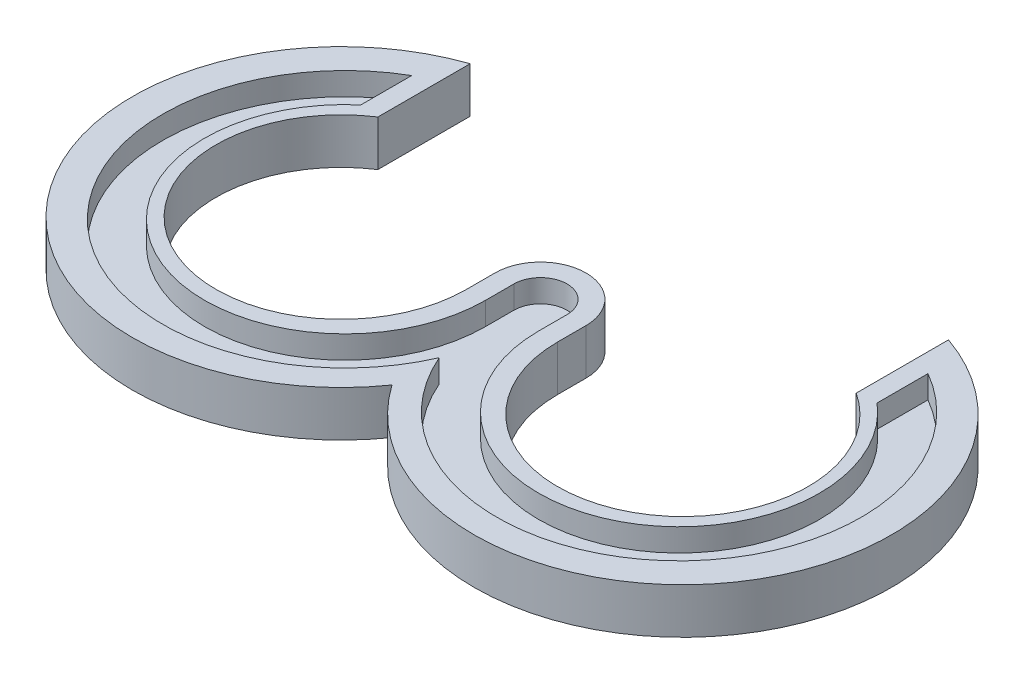
ISO-10303-21;
HEADER;
FILE_DESCRIPTION(('STEP AP214'),'2;1');
FILE_NAME('part.step','',(''),(''),'','','');
FILE_SCHEMA(('AUTOMOTIVE_DESIGN { 1 0 10303 214 1 1 1 1 }'));
ENDSEC;
DATA;
#1=APPLICATION_CONTEXT('core data for automotive mechanical design processes');
#2=APPLICATION_PROTOCOL_DEFINITION('international standard','automotive_design',2000,#1);
#3=PRODUCT_CONTEXT('',#1,'mechanical');
#4=PRODUCT('Part','Part','',(#3));
#5=PRODUCT_RELATED_PRODUCT_CATEGORY('part','',(#4));
#6=PRODUCT_DEFINITION_FORMATION('','',#4);
#7=PRODUCT_DEFINITION_CONTEXT('part definition',#1,'design');
#8=PRODUCT_DEFINITION('design','',#6,#7);
#9=PRODUCT_DEFINITION_SHAPE('','',#8);
#10=(LENGTH_UNIT() NAMED_UNIT(*) SI_UNIT(.MILLI.,.METRE.));
#11=(NAMED_UNIT(*) PLANE_ANGLE_UNIT() SI_UNIT($,.RADIAN.));
#12=(NAMED_UNIT(*) SI_UNIT($,.STERADIAN.) SOLID_ANGLE_UNIT());
#13=UNCERTAINTY_MEASURE_WITH_UNIT(LENGTH_MEASURE(1.E-05),#10,'distance_accuracy_value','');
#14=(GEOMETRIC_REPRESENTATION_CONTEXT(3) GLOBAL_UNCERTAINTY_ASSIGNED_CONTEXT((#13)) GLOBAL_UNIT_ASSIGNED_CONTEXT((#10,
#11,#12)) REPRESENTATION_CONTEXT('',''));
#15=CARTESIAN_POINT('',(0.,0.,0.));
#16=DIRECTION('',(0.,0.,1.));
#17=DIRECTION('',(1.,0.,0.));
#18=AXIS2_PLACEMENT_3D('',#15,#16,#17);
#19=CARTESIAN_POINT('',(-22.5,6.,3.75));
#20=DIRECTION('',(0.,-1.,0.));
#21=DIRECTION('',(0.,0.,-1.));
#22=AXIS2_PLACEMENT_3D('',#19,#20,#21);
#23=CYLINDRICAL_SURFACE('',#22,16.5);
#24=CARTESIAN_POINT('',(-22.5,0.,3.75));
#25=DIRECTION('',(0.,-1.,0.));
#26=DIRECTION('',(0.,0.,1.));
#27=AXIS2_PLACEMENT_3D('',#24,#25,#26);
#28=CIRCLE('',#27,16.5);
#29=CARTESIAN_POINT('',(-5.99999999999999,0.,3.75));
#30=VERTEX_POINT('',#29);
#31=CARTESIAN_POINT('',(-31.5,0.,-10.0793166859393));
#32=VERTEX_POINT('',#31);
#33=EDGE_CURVE('E147',#30,#32,#28,.T.);
#34=ORIENTED_EDGE('',*,*,#33,.T.);
#35=DIRECTION('',(0.,-1.,0.));
#36=VECTOR('',#35,1.);
#37=CARTESIAN_POINT('',(-31.5,6.,-10.0793166859393));
#38=LINE('',#37,#36);
#39=CARTESIAN_POINT('',(-31.5,6.,-10.0793166859393));
#40=VERTEX_POINT('',#39);
#41=EDGE_CURVE('E11',#40,#32,#38,.T.);
#42=ORIENTED_EDGE('',*,*,#41,.F.);
#43=CARTESIAN_POINT('',(-22.5,6.,3.75));
#44=DIRECTION('',(0.,-1.,0.));
#45=DIRECTION('',(0.,0.,1.));
#46=AXIS2_PLACEMENT_3D('',#43,#44,#45);
#47=CIRCLE('',#46,16.5);
#48=CARTESIAN_POINT('',(-5.99999999999999,6.,3.75));
#49=VERTEX_POINT('',#48);
#50=EDGE_CURVE('E165',#49,#40,#47,.T.);
#51=ORIENTED_EDGE('',*,*,#50,.F.);
#52=DIRECTION('',(0.,-1.,0.));
#53=VECTOR('',#52,1.);
#54=CARTESIAN_POINT('',(-5.99999999999999,6.,3.75));
#55=LINE('',#54,#53);
#56=EDGE_CURVE('E143',#49,#30,#55,.T.);
#57=ORIENTED_EDGE('',*,*,#56,.T.);
#58=EDGE_LOOP('',(#34,#42,#51,#57));
#59=FACE_BOUND('',#58,.T.);
#60=ADVANCED_FACE('F33',(#59),#23,.F.);
#61=CARTESIAN_POINT('',(-31.5,6.,-22.2355729203726));
#62=DIRECTION('',(-1.,0.,0.));
#63=DIRECTION('',(0.,0.,1.));
#64=AXIS2_PLACEMENT_3D('',#61,#62,#63);
#65=PLANE('',#64);
#66=DIRECTION('',(0.,0.,-1.));
#67=VECTOR('',#66,1.);
#68=CARTESIAN_POINT('',(-31.5,0.,-22.2355729203726));
#69=LINE('',#68,#67);
#70=CARTESIAN_POINT('',(-31.5,0.,-22.2355729203726));
#71=VERTEX_POINT('',#70);
#72=EDGE_CURVE('E150',#32,#71,#69,.T.);
#73=ORIENTED_EDGE('',*,*,#72,.T.);
#74=DIRECTION('',(0.,-1.,0.));
#75=VECTOR('',#74,1.);
#76=CARTESIAN_POINT('',(-31.5,6.,-22.2355729203726));
#77=LINE('',#76,#75);
#78=CARTESIAN_POINT('',(-31.5,6.,-22.2355729203726));
#79=VERTEX_POINT('',#78);
#80=EDGE_CURVE('E40',#79,#71,#77,.T.);
#81=ORIENTED_EDGE('',*,*,#80,.F.);
#82=DIRECTION('',(0.,0.,-1.));
#83=VECTOR('',#82,1.);
#84=CARTESIAN_POINT('',(-31.5,6.,-22.2355729203726));
#85=LINE('',#84,#83);
#86=EDGE_CURVE('E100',#40,#79,#85,.T.);
#87=ORIENTED_EDGE('',*,*,#86,.F.);
#88=ORIENTED_EDGE('',*,*,#41,.T.);
#89=EDGE_LOOP('',(#73,#81,#87,#88));
#90=FACE_BOUND('',#89,.T.);
#91=ADVANCED_FACE('F365',(#90),#65,.F.);
#92=CARTESIAN_POINT('',(-22.5,6.,3.75));
#93=DIRECTION('',(0.,-1.,0.));
#94=DIRECTION('',(0.,0.,-1.));
#95=AXIS2_PLACEMENT_3D('',#92,#93,#94);
#96=CYLINDRICAL_SURFACE('',#95,27.5);
#97=CARTESIAN_POINT('',(-22.5,0.,3.75));
#98=DIRECTION('',(0.,1.,0.));
#99=DIRECTION('',(0.,0.,1.));
#100=AXIS2_PLACEMENT_3D('',#97,#98,#99);
#101=CIRCLE('',#100,27.5);
#102=CARTESIAN_POINT('',(0.,0.,19.5613883008419));
#103=VERTEX_POINT('',#102);
#104=EDGE_CURVE('E153',#71,#103,#101,.T.);
#105=ORIENTED_EDGE('',*,*,#104,.T.);
#106=DIRECTION('',(0.,-1.,0.));
#107=VECTOR('',#106,1.);
#108=CARTESIAN_POINT('',(0.,6.,19.5613883008419));
#109=LINE('',#108,#107);
#110=CARTESIAN_POINT('',(0.,6.,19.5613883008419));
#111=VERTEX_POINT('',#110);
#112=EDGE_CURVE('E175',#111,#103,#109,.T.);
#113=ORIENTED_EDGE('',*,*,#112,.F.);
#114=CARTESIAN_POINT('',(-22.5,6.,3.75));
#115=DIRECTION('',(0.,1.,0.));
#116=DIRECTION('',(0.,0.,1.));
#117=AXIS2_PLACEMENT_3D('',#114,#115,#116);
#118=CIRCLE('',#117,27.5);
#119=EDGE_CURVE('E183',#79,#111,#118,.T.);
#120=ORIENTED_EDGE('',*,*,#119,.F.);
#121=ORIENTED_EDGE('',*,*,#80,.T.);
#122=EDGE_LOOP('',(#105,#113,#120,#121));
#123=FACE_BOUND('',#122,.T.);
#124=ADVANCED_FACE('F181',(#123),#96,.T.);
#125=CARTESIAN_POINT('',(22.5,6.,3.75));
#126=DIRECTION('',(0.,-1.,0.));
#127=DIRECTION('',(0.,0.,-1.));
#128=AXIS2_PLACEMENT_3D('',#125,#126,#127);
#129=CYLINDRICAL_SURFACE('',#128,27.5);
#130=CARTESIAN_POINT('',(22.5,0.,3.75));
#131=DIRECTION('',(0.,1.,0.));
#132=DIRECTION('',(0.,0.,1.));
#133=AXIS2_PLACEMENT_3D('',#130,#131,#132);
#134=CIRCLE('',#133,27.5);
#135=CARTESIAN_POINT('',(31.5,0.,-22.2355729203726));
#136=VERTEX_POINT('',#135);
#137=EDGE_CURVE('E155',#103,#136,#134,.T.);
#138=ORIENTED_EDGE('',*,*,#137,.T.);
#139=DIRECTION('',(0.,-1.,0.));
#140=VECTOR('',#139,1.);
#141=CARTESIAN_POINT('',(31.5,6.,-22.2355729203726));
#142=LINE('',#141,#140);
#143=CARTESIAN_POINT('',(31.5,6.,-22.2355729203726));
#144=VERTEX_POINT('',#143);
#145=EDGE_CURVE('E172',#144,#136,#142,.T.);
#146=ORIENTED_EDGE('',*,*,#145,.F.);
#147=CARTESIAN_POINT('',(22.5,6.,3.75));
#148=DIRECTION('',(0.,1.,0.));
#149=DIRECTION('',(0.,0.,1.));
#150=AXIS2_PLACEMENT_3D('',#147,#148,#149);
#151=CIRCLE('',#150,27.5);
#152=EDGE_CURVE('E199',#111,#144,#151,.T.);
#153=ORIENTED_EDGE('',*,*,#152,.F.);
#154=ORIENTED_EDGE('',*,*,#112,.T.);
#155=EDGE_LOOP('',(#138,#146,#153,#154));
#156=FACE_BOUND('',#155,.T.);
#157=ADVANCED_FACE('F192',(#156),#129,.T.);
#158=CARTESIAN_POINT('',(31.5,6.,-22.2355729203726));
#159=DIRECTION('',(1.,0.,0.));
#160=DIRECTION('',(0.,0.,-1.));
#161=AXIS2_PLACEMENT_3D('',#158,#159,#160);
#162=PLANE('',#161);
#163=DIRECTION('',(0.,0.,1.));
#164=VECTOR('',#163,1.);
#165=CARTESIAN_POINT('',(31.5,0.,-22.2355729203726));
#166=LINE('',#165,#164);
#167=CARTESIAN_POINT('',(31.5,0.,-10.0793166859393));
#168=VERTEX_POINT('',#167);
#169=EDGE_CURVE('E157',#136,#168,#166,.T.);
#170=ORIENTED_EDGE('',*,*,#169,.T.);
#171=DIRECTION('',(0.,-1.,0.));
#172=VECTOR('',#171,1.);
#173=CARTESIAN_POINT('',(31.5,6.,-10.0793166859393));
#174=LINE('',#173,#172);
#175=CARTESIAN_POINT('',(31.5,6.,-10.0793166859393));
#176=VERTEX_POINT('',#175);
#177=EDGE_CURVE('E169',#176,#168,#174,.T.);
#178=ORIENTED_EDGE('',*,*,#177,.F.);
#179=DIRECTION('',(0.,0.,1.));
#180=VECTOR('',#179,1.);
#181=CARTESIAN_POINT('',(31.5,6.,-22.2355729203726));
#182=LINE('',#181,#180);
#183=EDGE_CURVE('E198',#144,#176,#182,.T.);
#184=ORIENTED_EDGE('',*,*,#183,.F.);
#185=ORIENTED_EDGE('',*,*,#145,.T.);
#186=EDGE_LOOP('',(#170,#178,#184,#185));
#187=FACE_BOUND('',#186,.T.);
#188=ADVANCED_FACE('F196',(#187),#162,.F.);
#189=CARTESIAN_POINT('',(22.5,6.,3.75));
#190=DIRECTION('',(0.,-1.,0.));
#191=DIRECTION('',(0.,0.,-1.));
#192=AXIS2_PLACEMENT_3D('',#189,#190,#191);
#193=CYLINDRICAL_SURFACE('',#192,16.5);
#194=CARTESIAN_POINT('',(22.5,0.,3.75));
#195=DIRECTION('',(0.,-1.,0.));
#196=DIRECTION('',(0.,0.,1.));
#197=AXIS2_PLACEMENT_3D('',#194,#195,#196);
#198=CIRCLE('',#197,16.5);
#199=CARTESIAN_POINT('',(5.99999999999999,0.,3.75));
#200=VERTEX_POINT('',#199);
#201=EDGE_CURVE('E159',#168,#200,#198,.T.);
#202=ORIENTED_EDGE('',*,*,#201,.T.);
#203=DIRECTION('',(0.,-1.,0.));
#204=VECTOR('',#203,1.);
#205=CARTESIAN_POINT('',(5.99999999999999,6.,3.75));
#206=LINE('',#205,#204);
#207=CARTESIAN_POINT('',(5.99999999999999,6.,3.75));
#208=VERTEX_POINT('',#207);
#209=EDGE_CURVE('E138',#208,#200,#206,.T.);
#210=ORIENTED_EDGE('',*,*,#209,.F.);
#211=CARTESIAN_POINT('',(22.5,6.,3.75));
#212=DIRECTION('',(0.,-1.,0.));
#213=DIRECTION('',(0.,0.,1.));
#214=AXIS2_PLACEMENT_3D('',#211,#212,#213);
#215=CIRCLE('',#214,16.5);
#216=EDGE_CURVE('E126',#176,#208,#215,.T.);
#217=ORIENTED_EDGE('',*,*,#216,.F.);
#218=ORIENTED_EDGE('',*,*,#177,.T.);
#219=EDGE_LOOP('',(#202,#210,#217,#218));
#220=FACE_BOUND('',#219,.T.);
#221=ADVANCED_FACE('F385',(#220),#193,.F.);
#222=CARTESIAN_POINT('',(5.99999999999999,6.,3.75));
#223=DIRECTION('',(-1.,0.,0.));
#224=DIRECTION('',(0.,0.,1.));
#225=AXIS2_PLACEMENT_3D('',#222,#223,#224);
#226=PLANE('',#225);
#227=DIRECTION('',(0.,0.,-1.));
#228=VECTOR('',#227,1.);
#229=CARTESIAN_POINT('',(5.99999999999999,0.,3.75));
#230=LINE('',#229,#228);
#231=CARTESIAN_POINT('',(5.99999999999999,0.,0.));
#232=VERTEX_POINT('',#231);
#233=EDGE_CURVE('E135',#200,#232,#230,.T.);
#234=ORIENTED_EDGE('',*,*,#233,.T.);
#235=DIRECTION('',(0.,-1.,0.));
#236=VECTOR('',#235,1.);
#237=CARTESIAN_POINT('',(5.99999999999999,6.,0.));
#238=LINE('',#237,#236);
#239=CARTESIAN_POINT('',(5.99999999999999,6.,0.));
#240=VERTEX_POINT('',#239);
#241=EDGE_CURVE('E132',#240,#232,#238,.T.);
#242=ORIENTED_EDGE('',*,*,#241,.F.);
#243=DIRECTION('',(0.,0.,-1.));
#244=VECTOR('',#243,1.);
#245=CARTESIAN_POINT('',(5.99999999999999,6.,3.75));
#246=LINE('',#245,#244);
#247=EDGE_CURVE('E119',#208,#240,#246,.T.);
#248=ORIENTED_EDGE('',*,*,#247,.F.);
#249=ORIENTED_EDGE('',*,*,#209,.T.);
#250=EDGE_LOOP('',(#234,#242,#248,#249));
#251=FACE_BOUND('',#250,.T.);
#252=ADVANCED_FACE('F133',(#251),#226,.F.);
#253=CARTESIAN_POINT('',(0.,6.,0.));
#254=DIRECTION('',(0.,-1.,0.));
#255=DIRECTION('',(0.,0.,-1.));
#256=AXIS2_PLACEMENT_3D('',#253,#254,#255);
#257=CYLINDRICAL_SURFACE('',#256,5.99999999999999);
#258=CARTESIAN_POINT('',(0.,0.,0.));
#259=DIRECTION('',(0.,1.,0.));
#260=DIRECTION('',(0.,0.,-1.));
#261=AXIS2_PLACEMENT_3D('',#258,#259,#260);
#262=CIRCLE('',#261,5.99999999999999);
#263=CARTESIAN_POINT('',(-5.99999999999999,0.,0.));
#264=VERTEX_POINT('',#263);
#265=EDGE_CURVE('E162',#232,#264,#262,.T.);
#266=ORIENTED_EDGE('',*,*,#265,.T.);
#267=DIRECTION('',(0.,-1.,0.));
#268=VECTOR('',#267,1.);
#269=CARTESIAN_POINT('',(-5.99999999999999,6.,0.));
#270=LINE('',#269,#268);
#271=CARTESIAN_POINT('',(-5.99999999999999,6.,0.));
#272=VERTEX_POINT('',#271);
#273=EDGE_CURVE('E139',#272,#264,#270,.T.);
#274=ORIENTED_EDGE('',*,*,#273,.F.);
#275=CARTESIAN_POINT('',(0.,6.,0.));
#276=DIRECTION('',(0.,1.,0.));
#277=DIRECTION('',(0.,0.,-1.));
#278=AXIS2_PLACEMENT_3D('',#275,#276,#277);
#279=CIRCLE('',#278,5.99999999999999);
#280=EDGE_CURVE('E123',#240,#272,#279,.T.);
#281=ORIENTED_EDGE('',*,*,#280,.F.);
#282=ORIENTED_EDGE('',*,*,#241,.T.);
#283=EDGE_LOOP('',(#266,#274,#281,#282));
#284=FACE_BOUND('',#283,.T.);
#285=ADVANCED_FACE('F141',(#284),#257,.T.);
#286=CARTESIAN_POINT('',(-5.99999999999999,6.,3.75));
#287=DIRECTION('',(1.,0.,0.));
#288=DIRECTION('',(0.,0.,-1.));
#289=AXIS2_PLACEMENT_3D('',#286,#287,#288);
#290=PLANE('',#289);
#291=DIRECTION('',(0.,0.,1.));
#292=VECTOR('',#291,1.);
#293=CARTESIAN_POINT('',(-5.99999999999999,0.,3.75));
#294=LINE('',#293,#292);
#295=EDGE_CURVE('E92',#264,#30,#294,.T.);
#296=ORIENTED_EDGE('',*,*,#295,.T.);
#297=ORIENTED_EDGE('',*,*,#56,.F.);
#298=DIRECTION('',(0.,0.,1.));
#299=VECTOR('',#298,1.);
#300=CARTESIAN_POINT('',(-5.99999999999999,6.,3.75));
#301=LINE('',#300,#299);
#302=EDGE_CURVE('E56',#272,#49,#301,.T.);
#303=ORIENTED_EDGE('',*,*,#302,.F.);
#304=ORIENTED_EDGE('',*,*,#273,.T.);
#305=EDGE_LOOP('',(#296,#297,#303,#304));
#306=FACE_BOUND('',#305,.T.);
#307=ADVANCED_FACE('F372',(#306),#290,.F.);
#308=CARTESIAN_POINT('',(-22.5,6.,3.75));
#309=DIRECTION('',(0.,1.,0.));
#310=DIRECTION('',(0.,0.,1.));
#311=AXIS2_PLACEMENT_3D('',#308,#309,#310);
#312=PLANE('',#311);
#313=CARTESIAN_POINT('',(-22.,6.,3.75));
#314=DIRECTION('',(0.,-1.,0.));
#315=DIRECTION('',(0.,0.,1.));
#316=AXIS2_PLACEMENT_3D('',#313,#314,#315);
#317=CIRCLE('',#316,18.5);
#318=CARTESIAN_POINT('',(-3.5,6.,3.75));
#319=VERTEX_POINT('',#318);
#320=CARTESIAN_POINT('',(-34.,6.,-10.3301278403287));
#321=VERTEX_POINT('',#320);
#322=EDGE_CURVE('E47',#319,#321,#317,.T.);
#323=ORIENTED_EDGE('',*,*,#322,.F.);
#324=DIRECTION('',(0.,0.,1.));
#325=VECTOR('',#324,1.);
#326=CARTESIAN_POINT('',(-3.5,6.,3.75));
#327=LINE('',#326,#325);
#328=CARTESIAN_POINT('',(-3.5,6.,0.));
#329=VERTEX_POINT('',#328);
#330=EDGE_CURVE('E231',#329,#319,#327,.T.);
#331=ORIENTED_EDGE('',*,*,#330,.F.);
#332=CARTESIAN_POINT('',(0.,6.,0.));
#333=DIRECTION('',(0.,1.,0.));
#334=DIRECTION('',(0.,0.,-1.));
#335=AXIS2_PLACEMENT_3D('',#332,#333,#334);
#336=CIRCLE('',#335,3.5);
#337=CARTESIAN_POINT('',(3.5,6.,0.));
#338=VERTEX_POINT('',#337);
#339=EDGE_CURVE('E235',#338,#329,#336,.T.);
#340=ORIENTED_EDGE('',*,*,#339,.F.);
#341=DIRECTION('',(0.,0.,-1.));
#342=VECTOR('',#341,1.);
#343=CARTESIAN_POINT('',(3.5,6.,3.75));
#344=LINE('',#343,#342);
#345=CARTESIAN_POINT('',(3.5,6.,3.75));
#346=VERTEX_POINT('',#345);
#347=EDGE_CURVE('E238',#346,#338,#344,.T.);
#348=ORIENTED_EDGE('',*,*,#347,.F.);
#349=CARTESIAN_POINT('',(22.,6.,3.75));
#350=DIRECTION('',(0.,-1.,0.));
#351=DIRECTION('',(0.,0.,1.));
#352=AXIS2_PLACEMENT_3D('',#349,#350,#351);
#353=CIRCLE('',#352,18.5);
#354=CARTESIAN_POINT('',(34.,6.,-10.3301278403287));
#355=VERTEX_POINT('',#354);
#356=EDGE_CURVE('E241',#355,#346,#353,.T.);
#357=ORIENTED_EDGE('',*,*,#356,.F.);
#358=DIRECTION('',(0.,0.,1.));
#359=VECTOR('',#358,1.);
#360=CARTESIAN_POINT('',(34.,6.,-17.0346096908265));
#361=LINE('',#360,#359);
#362=CARTESIAN_POINT('',(34.,6.,-17.0346096908265));
#363=VERTEX_POINT('',#362);
#364=EDGE_CURVE('E244',#363,#355,#361,.T.);
#365=ORIENTED_EDGE('',*,*,#364,.F.);
#366=CARTESIAN_POINT('',(22.,6.,3.75));
#367=DIRECTION('',(0.,1.,0.));
#368=DIRECTION('',(0.,0.,1.));
#369=AXIS2_PLACEMENT_3D('',#366,#367,#368);
#370=CIRCLE('',#369,24.);
#371=CARTESIAN_POINT('',(0.,6.,13.3416630466254));
#372=VERTEX_POINT('',#371);
#373=EDGE_CURVE('E247',#372,#363,#370,.T.);
#374=ORIENTED_EDGE('',*,*,#373,.F.);
#375=CARTESIAN_POINT('',(-22.,6.,3.75));
#376=DIRECTION('',(0.,1.,0.));
#377=DIRECTION('',(0.,0.,1.));
#378=AXIS2_PLACEMENT_3D('',#375,#376,#377);
#379=CIRCLE('',#378,24.);
#380=CARTESIAN_POINT('',(-34.,6.,-17.0346096908265));
#381=VERTEX_POINT('',#380);
#382=EDGE_CURVE('E250',#381,#372,#379,.T.);
#383=ORIENTED_EDGE('',*,*,#382,.F.);
#384=DIRECTION('',(0.,0.,-1.));
#385=VECTOR('',#384,1.);
#386=CARTESIAN_POINT('',(-34.,6.,-17.0346096908265));
#387=LINE('',#386,#385);
#388=EDGE_CURVE('E253',#321,#381,#387,.T.);
#389=ORIENTED_EDGE('',*,*,#388,.F.);
#390=EDGE_LOOP('',(#323,#331,#340,#348,#357,#365,#374,#383,#389));
#391=FACE_BOUND('',#390,.T.);
#392=ORIENTED_EDGE('',*,*,#50,.T.);
#393=ORIENTED_EDGE('',*,*,#86,.T.);
#394=ORIENTED_EDGE('',*,*,#119,.T.);
#395=ORIENTED_EDGE('',*,*,#152,.T.);
#396=ORIENTED_EDGE('',*,*,#183,.T.);
#397=ORIENTED_EDGE('',*,*,#216,.T.);
#398=ORIENTED_EDGE('',*,*,#247,.T.);
#399=ORIENTED_EDGE('',*,*,#280,.T.);
#400=ORIENTED_EDGE('',*,*,#302,.T.);
#401=EDGE_LOOP('',(#392,#393,#394,#395,#396,#397,#398,#399,#400));
#402=FACE_BOUND('',#401,.T.);
#403=ADVANCED_FACE('F121',(#391,#402),#312,.T.);
#404=CARTESIAN_POINT('',(-22.5,0.,3.75));
#405=DIRECTION('',(0.,1.,0.));
#406=DIRECTION('',(0.,0.,1.));
#407=AXIS2_PLACEMENT_3D('',#404,#405,#406);
#408=PLANE('',#407);
#409=ORIENTED_EDGE('',*,*,#33,.F.);
#410=ORIENTED_EDGE('',*,*,#295,.F.);
#411=ORIENTED_EDGE('',*,*,#265,.F.);
#412=ORIENTED_EDGE('',*,*,#233,.F.);
#413=ORIENTED_EDGE('',*,*,#201,.F.);
#414=ORIENTED_EDGE('',*,*,#169,.F.);
#415=ORIENTED_EDGE('',*,*,#137,.F.);
#416=ORIENTED_EDGE('',*,*,#104,.F.);
#417=ORIENTED_EDGE('',*,*,#72,.F.);
#418=EDGE_LOOP('',(#409,#410,#411,#412,#413,#414,#415,#416,#417));
#419=FACE_BOUND('',#418,.T.);
#420=ADVANCED_FACE('F187',(#419),#408,.F.);
#421=CARTESIAN_POINT('',(-22.,3.,3.75));
#422=DIRECTION('',(0.,1.,0.));
#423=DIRECTION('',(0.,0.,1.));
#424=AXIS2_PLACEMENT_3D('',#421,#422,#423);
#425=CYLINDRICAL_SURFACE('',#424,18.5);
#426=ORIENTED_EDGE('',*,*,#322,.T.);
#427=DIRECTION('',(0.,1.,0.));
#428=VECTOR('',#427,1.);
#429=CARTESIAN_POINT('',(-34.,3.,-10.3301278403287));
#430=LINE('',#429,#428);
#431=CARTESIAN_POINT('',(-34.,3.,-10.3301278403287));
#432=VERTEX_POINT('',#431);
#433=EDGE_CURVE('E206',#432,#321,#430,.T.);
#434=ORIENTED_EDGE('',*,*,#433,.F.);
#435=CARTESIAN_POINT('',(-22.,3.,3.75));
#436=DIRECTION('',(0.,-1.,0.));
#437=DIRECTION('',(0.,0.,1.));
#438=AXIS2_PLACEMENT_3D('',#435,#436,#437);
#439=CIRCLE('',#438,18.5);
#440=CARTESIAN_POINT('',(-3.5,3.,3.75));
#441=VERTEX_POINT('',#440);
#442=EDGE_CURVE('E234',#441,#432,#439,.T.);
#443=ORIENTED_EDGE('',*,*,#442,.F.);
#444=DIRECTION('',(0.,1.,0.));
#445=VECTOR('',#444,1.);
#446=CARTESIAN_POINT('',(-3.5,3.,3.75));
#447=LINE('',#446,#445);
#448=EDGE_CURVE('E151',#441,#319,#447,.T.);
#449=ORIENTED_EDGE('',*,*,#448,.T.);
#450=EDGE_LOOP('',(#426,#434,#443,#449));
#451=FACE_BOUND('',#450,.T.);
#452=ADVANCED_FACE('F289',(#451),#425,.T.);
#453=CARTESIAN_POINT('',(-3.5,3.,3.75));
#454=DIRECTION('',(-1.,0.,0.));
#455=DIRECTION('',(0.,0.,1.));
#456=AXIS2_PLACEMENT_3D('',#453,#454,#455);
#457=PLANE('',#456);
#458=ORIENTED_EDGE('',*,*,#330,.T.);
#459=ORIENTED_EDGE('',*,*,#448,.F.);
#460=DIRECTION('',(0.,0.,1.));
#461=VECTOR('',#460,1.);
#462=CARTESIAN_POINT('',(-3.5,3.,3.75));
#463=LINE('',#462,#461);
#464=CARTESIAN_POINT('',(-3.5,3.,0.));
#465=VERTEX_POINT('',#464);
#466=EDGE_CURVE('E209',#465,#441,#463,.T.);
#467=ORIENTED_EDGE('',*,*,#466,.F.);
#468=DIRECTION('',(0.,1.,0.));
#469=VECTOR('',#468,1.);
#470=CARTESIAN_POINT('',(-3.5,3.,0.));
#471=LINE('',#470,#469);
#472=EDGE_CURVE('E227',#465,#329,#471,.T.);
#473=ORIENTED_EDGE('',*,*,#472,.T.);
#474=EDGE_LOOP('',(#458,#459,#467,#473));
#475=FACE_BOUND('',#474,.T.);
#476=ADVANCED_FACE('F311',(#475),#457,.F.);
#477=CARTESIAN_POINT('',(0.,3.,0.));
#478=DIRECTION('',(0.,1.,0.));
#479=DIRECTION('',(0.,0.,1.));
#480=AXIS2_PLACEMENT_3D('',#477,#478,#479);
#481=CYLINDRICAL_SURFACE('',#480,3.5);
#482=ORIENTED_EDGE('',*,*,#339,.T.);
#483=ORIENTED_EDGE('',*,*,#472,.F.);
#484=CARTESIAN_POINT('',(0.,3.,0.));
#485=DIRECTION('',(0.,1.,0.));
#486=DIRECTION('',(0.,0.,-1.));
#487=AXIS2_PLACEMENT_3D('',#484,#485,#486);
#488=CIRCLE('',#487,3.5);
#489=CARTESIAN_POINT('',(3.5,3.,0.));
#490=VERTEX_POINT('',#489);
#491=EDGE_CURVE('E259',#490,#465,#488,.T.);
#492=ORIENTED_EDGE('',*,*,#491,.F.);
#493=DIRECTION('',(0.,1.,0.));
#494=VECTOR('',#493,1.);
#495=CARTESIAN_POINT('',(3.5,3.,0.));
#496=LINE('',#495,#494);
#497=EDGE_CURVE('E224',#490,#338,#496,.T.);
#498=ORIENTED_EDGE('',*,*,#497,.T.);
#499=EDGE_LOOP('',(#482,#483,#492,#498));
#500=FACE_BOUND('',#499,.T.);
#501=ADVANCED_FACE('F316',(#500),#481,.F.);
#502=CARTESIAN_POINT('',(3.5,3.,3.75));
#503=DIRECTION('',(1.,0.,0.));
#504=DIRECTION('',(0.,0.,-1.));
#505=AXIS2_PLACEMENT_3D('',#502,#503,#504);
#506=PLANE('',#505);
#507=ORIENTED_EDGE('',*,*,#347,.T.);
#508=ORIENTED_EDGE('',*,*,#497,.F.);
#509=DIRECTION('',(0.,0.,-1.));
#510=VECTOR('',#509,1.);
#511=CARTESIAN_POINT('',(3.5,3.,3.75));
#512=LINE('',#511,#510);
#513=CARTESIAN_POINT('',(3.5,3.,3.75));
#514=VERTEX_POINT('',#513);
#515=EDGE_CURVE('E262',#514,#490,#512,.T.);
#516=ORIENTED_EDGE('',*,*,#515,.F.);
#517=DIRECTION('',(0.,1.,0.));
#518=VECTOR('',#517,1.);
#519=CARTESIAN_POINT('',(3.5,3.,3.75));
#520=LINE('',#519,#518);
#521=EDGE_CURVE('E221',#514,#346,#520,.T.);
#522=ORIENTED_EDGE('',*,*,#521,.T.);
#523=EDGE_LOOP('',(#507,#508,#516,#522));
#524=FACE_BOUND('',#523,.T.);
#525=ADVANCED_FACE('F345',(#524),#506,.F.);
#526=CARTESIAN_POINT('',(22.,3.,3.75));
#527=DIRECTION('',(0.,1.,0.));
#528=DIRECTION('',(0.,0.,1.));
#529=AXIS2_PLACEMENT_3D('',#526,#527,#528);
#530=CYLINDRICAL_SURFACE('',#529,18.5);
#531=ORIENTED_EDGE('',*,*,#356,.T.);
#532=ORIENTED_EDGE('',*,*,#521,.F.);
#533=CARTESIAN_POINT('',(22.,3.,3.75));
#534=DIRECTION('',(0.,-1.,0.));
#535=DIRECTION('',(0.,0.,1.));
#536=AXIS2_PLACEMENT_3D('',#533,#534,#535);
#537=CIRCLE('',#536,18.5);
#538=CARTESIAN_POINT('',(34.,3.,-10.3301278403287));
#539=VERTEX_POINT('',#538);
#540=EDGE_CURVE('E265',#539,#514,#537,.T.);
#541=ORIENTED_EDGE('',*,*,#540,.F.);
#542=DIRECTION('',(0.,1.,0.));
#543=VECTOR('',#542,1.);
#544=CARTESIAN_POINT('',(34.,3.,-10.3301278403287));
#545=LINE('',#544,#543);
#546=EDGE_CURVE('E218',#539,#355,#545,.T.);
#547=ORIENTED_EDGE('',*,*,#546,.T.);
#548=EDGE_LOOP('',(#531,#532,#541,#547));
#549=FACE_BOUND('',#548,.T.);
#550=ADVANCED_FACE('F349',(#549),#530,.T.);
#551=CARTESIAN_POINT('',(34.,3.,-17.0346096908265));
#552=DIRECTION('',(-1.,0.,0.));
#553=DIRECTION('',(0.,0.,1.));
#554=AXIS2_PLACEMENT_3D('',#551,#552,#553);
#555=PLANE('',#554);
#556=ORIENTED_EDGE('',*,*,#364,.T.);
#557=ORIENTED_EDGE('',*,*,#546,.F.);
#558=DIRECTION('',(0.,0.,1.));
#559=VECTOR('',#558,1.);
#560=CARTESIAN_POINT('',(34.,3.,-17.0346096908265));
#561=LINE('',#560,#559);
#562=CARTESIAN_POINT('',(34.,3.,-17.0346096908265));
#563=VERTEX_POINT('',#562);
#564=EDGE_CURVE('E268',#563,#539,#561,.T.);
#565=ORIENTED_EDGE('',*,*,#564,.F.);
#566=DIRECTION('',(0.,1.,0.));
#567=VECTOR('',#566,1.);
#568=CARTESIAN_POINT('',(34.,3.,-17.0346096908265));
#569=LINE('',#568,#567);
#570=EDGE_CURVE('E215',#563,#363,#569,.T.);
#571=ORIENTED_EDGE('',*,*,#570,.T.);
#572=EDGE_LOOP('',(#556,#557,#565,#571));
#573=FACE_BOUND('',#572,.T.);
#574=ADVANCED_FACE('F353',(#573),#555,.F.);
#575=CARTESIAN_POINT('',(22.,3.,3.75));
#576=DIRECTION('',(0.,1.,0.));
#577=DIRECTION('',(0.,0.,1.));
#578=AXIS2_PLACEMENT_3D('',#575,#576,#577);
#579=CYLINDRICAL_SURFACE('',#578,24.);
#580=ORIENTED_EDGE('',*,*,#373,.T.);
#581=ORIENTED_EDGE('',*,*,#570,.F.);
#582=CARTESIAN_POINT('',(22.,3.,3.75));
#583=DIRECTION('',(0.,1.,0.));
#584=DIRECTION('',(0.,0.,1.));
#585=AXIS2_PLACEMENT_3D('',#582,#583,#584);
#586=CIRCLE('',#585,24.);
#587=CARTESIAN_POINT('',(0.,3.,13.3416630466254));
#588=VERTEX_POINT('',#587);
#589=EDGE_CURVE('E271',#588,#563,#586,.T.);
#590=ORIENTED_EDGE('',*,*,#589,.F.);
#591=DIRECTION('',(0.,1.,0.));
#592=VECTOR('',#591,1.);
#593=CARTESIAN_POINT('',(0.,3.,13.3416630466254));
#594=LINE('',#593,#592);
#595=EDGE_CURVE('E212',#588,#372,#594,.T.);
#596=ORIENTED_EDGE('',*,*,#595,.T.);
#597=EDGE_LOOP('',(#580,#581,#590,#596));
#598=FACE_BOUND('',#597,.T.);
#599=ADVANCED_FACE('F355',(#598),#579,.F.);
#600=CARTESIAN_POINT('',(-22.,3.,3.75));
#601=DIRECTION('',(0.,1.,0.));
#602=DIRECTION('',(0.,0.,1.));
#603=AXIS2_PLACEMENT_3D('',#600,#601,#602);
#604=CYLINDRICAL_SURFACE('',#603,24.);
#605=ORIENTED_EDGE('',*,*,#382,.T.);
#606=ORIENTED_EDGE('',*,*,#595,.F.);
#607=CARTESIAN_POINT('',(-22.,3.,3.75));
#608=DIRECTION('',(0.,1.,0.));
#609=DIRECTION('',(0.,0.,1.));
#610=AXIS2_PLACEMENT_3D('',#607,#608,#609);
#611=CIRCLE('',#610,24.);
#612=CARTESIAN_POINT('',(-34.,3.,-17.0346096908265));
#613=VERTEX_POINT('',#612);
#614=EDGE_CURVE('E274',#613,#588,#611,.T.);
#615=ORIENTED_EDGE('',*,*,#614,.F.);
#616=DIRECTION('',(0.,1.,0.));
#617=VECTOR('',#616,1.);
#618=CARTESIAN_POINT('',(-34.,3.,-17.0346096908265));
#619=LINE('',#618,#617);
#620=EDGE_CURVE('E208',#613,#381,#619,.T.);
#621=ORIENTED_EDGE('',*,*,#620,.T.);
#622=EDGE_LOOP('',(#605,#606,#615,#621));
#623=FACE_BOUND('',#622,.T.);
#624=ADVANCED_FACE('F331',(#623),#604,.F.);
#625=CARTESIAN_POINT('',(-34.,3.,-17.0346096908265));
#626=DIRECTION('',(1.,0.,0.));
#627=DIRECTION('',(0.,0.,-1.));
#628=AXIS2_PLACEMENT_3D('',#625,#626,#627);
#629=PLANE('',#628);
#630=ORIENTED_EDGE('',*,*,#388,.T.);
#631=ORIENTED_EDGE('',*,*,#620,.F.);
#632=DIRECTION('',(0.,0.,-1.));
#633=VECTOR('',#632,1.);
#634=CARTESIAN_POINT('',(-34.,3.,-17.0346096908265));
#635=LINE('',#634,#633);
#636=EDGE_CURVE('E277',#432,#613,#635,.T.);
#637=ORIENTED_EDGE('',*,*,#636,.F.);
#638=ORIENTED_EDGE('',*,*,#433,.T.);
#639=EDGE_LOOP('',(#630,#631,#637,#638));
#640=FACE_BOUND('',#639,.T.);
#641=ADVANCED_FACE('F325',(#640),#629,.F.);
#642=CARTESIAN_POINT('',(-22.,3.,3.75));
#643=DIRECTION('',(0.,1.,0.));
#644=DIRECTION('',(0.,0.,1.));
#645=AXIS2_PLACEMENT_3D('',#642,#643,#644);
#646=PLANE('',#645);
#647=ORIENTED_EDGE('',*,*,#442,.T.);
#648=ORIENTED_EDGE('',*,*,#636,.T.);
#649=ORIENTED_EDGE('',*,*,#614,.T.);
#650=ORIENTED_EDGE('',*,*,#589,.T.);
#651=ORIENTED_EDGE('',*,*,#564,.T.);
#652=ORIENTED_EDGE('',*,*,#540,.T.);
#653=ORIENTED_EDGE('',*,*,#515,.T.);
#654=ORIENTED_EDGE('',*,*,#491,.T.);
#655=ORIENTED_EDGE('',*,*,#466,.T.);
#656=EDGE_LOOP('',(#647,#648,#649,#650,#651,#652,#653,#654,#655));
#657=FACE_BOUND('',#656,.T.);
#658=ADVANCED_FACE('F284',(#657),#646,.T.);
#659=CLOSED_SHELL('',(#60,#91,#124,#157,#188,#221,#252,#285,#307,#403,#420,#452,#476,#501,#525,
#550,#574,#599,#624,#641,#658));
#660=MANIFOLD_SOLID_BREP('B2',#659);
#661=ADVANCED_BREP_SHAPE_REPRESENTATION('',(#18,#660),#14);
#662=SHAPE_DEFINITION_REPRESENTATION(#9,#661);
ENDSEC;
END-ISO-10303-21;
